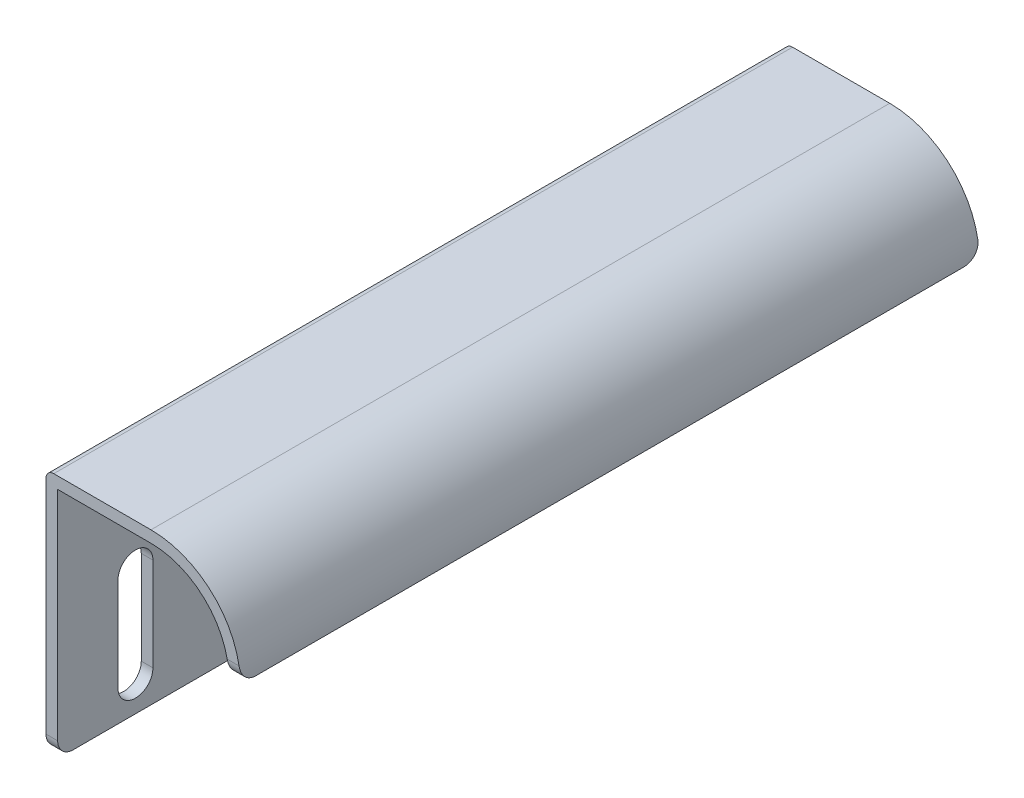
ISO-10303-21;
HEADER;
FILE_DESCRIPTION(('STEP AP214'),'2;1');
FILE_NAME('part.step','',(''),(''),'','','');
FILE_SCHEMA(('AUTOMOTIVE_DESIGN { 1 0 10303 214 1 1 1 1 }'));
ENDSEC;
DATA;
#1=APPLICATION_CONTEXT('core data for automotive mechanical design processes');
#2=APPLICATION_PROTOCOL_DEFINITION('international standard','automotive_design',2000,#1);
#3=PRODUCT_CONTEXT('',#1,'mechanical');
#4=PRODUCT('Part','Part','',(#3));
#5=PRODUCT_RELATED_PRODUCT_CATEGORY('part','',(#4));
#6=PRODUCT_DEFINITION_FORMATION('','',#4);
#7=PRODUCT_DEFINITION_CONTEXT('part definition',#1,'design');
#8=PRODUCT_DEFINITION('design','',#6,#7);
#9=PRODUCT_DEFINITION_SHAPE('','',#8);
#10=(LENGTH_UNIT() NAMED_UNIT(*) SI_UNIT(.MILLI.,.METRE.));
#11=(NAMED_UNIT(*) PLANE_ANGLE_UNIT() SI_UNIT($,.RADIAN.));
#12=(NAMED_UNIT(*) SI_UNIT($,.STERADIAN.) SOLID_ANGLE_UNIT());
#13=UNCERTAINTY_MEASURE_WITH_UNIT(LENGTH_MEASURE(1.E-05),#10,'distance_accuracy_value','');
#14=(GEOMETRIC_REPRESENTATION_CONTEXT(3) GLOBAL_UNCERTAINTY_ASSIGNED_CONTEXT((#13)) GLOBAL_UNIT_ASSIGNED_CONTEXT((#10,
#11,#12)) REPRESENTATION_CONTEXT('',''));
#15=CARTESIAN_POINT('',(0.,0.,0.));
#16=DIRECTION('',(0.,0.,1.));
#17=DIRECTION('',(1.,0.,0.));
#18=AXIS2_PLACEMENT_3D('',#15,#16,#17);
#19=CARTESIAN_POINT('',(-8.26339285714285,-19.4162946428571,95.));
#20=DIRECTION('',(0.,1.,0.));
#21=DIRECTION('',(0.,0.,1.));
#22=AXIS2_PLACEMENT_3D('',#19,#20,#21);
#23=PLANE('',#22);
#24=DIRECTION('',(0.,0.,-1.));
#25=VECTOR('',#24,1.);
#26=CARTESIAN_POINT('',(-8.26339285714285,-19.4162946428571,95.));
#27=LINE('',#26,#25);
#28=CARTESIAN_POINT('',(-8.26339285714285,-19.4162946428571,93.));
#29=VERTEX_POINT('',#28);
#30=CARTESIAN_POINT('',(-8.26339285714285,-19.4162946428571,2.));
#31=VERTEX_POINT('',#30);
#32=EDGE_CURVE('E296',#29,#31,#27,.T.);
#33=ORIENTED_EDGE('',*,*,#32,.F.);
#34=DIRECTION('',(1.,0.,0.));
#35=VECTOR('',#34,1.);
#36=CARTESIAN_POINT('',(-9.76339285714285,-19.4162946428571,93.));
#37=LINE('',#36,#35);
#38=CARTESIAN_POINT('',(-9.76339285714285,-19.4162946428571,93.));
#39=VERTEX_POINT('',#38);
#40=EDGE_CURVE('E321',#29,#39,#37,.F.);
#41=ORIENTED_EDGE('',*,*,#40,.T.);
#42=DIRECTION('',(0.,0.,-1.));
#43=VECTOR('',#42,1.);
#44=CARTESIAN_POINT('',(-9.76339285714285,-19.4162946428571,95.));
#45=LINE('',#44,#43);
#46=CARTESIAN_POINT('',(-9.76339285714285,-19.4162946428571,2.));
#47=VERTEX_POINT('',#46);
#48=EDGE_CURVE('E265',#39,#47,#45,.T.);
#49=ORIENTED_EDGE('',*,*,#48,.T.);
#50=DIRECTION('',(1.,0.,0.));
#51=VECTOR('',#50,1.);
#52=CARTESIAN_POINT('',(-8.26339285714285,-19.4162946428571,2.));
#53=LINE('',#52,#51);
#54=EDGE_CURVE('E318',#47,#31,#53,.T.);
#55=ORIENTED_EDGE('',*,*,#54,.T.);
#56=EDGE_LOOP('',(#33,#41,#49,#55));
#57=FACE_BOUND('',#56,.T.);
#58=ADVANCED_FACE('F33',(#57),#23,.F.);
#59=CARTESIAN_POINT('',(-8.26339285714285,10.5837053571429,95.));
#60=DIRECTION('',(-1.,0.,0.));
#61=DIRECTION('',(0.,-1.,0.));
#62=AXIS2_PLACEMENT_3D('',#59,#60,#61);
#63=PLANE('',#62);
#64=DIRECTION('',(0.,-1.,0.));
#65=VECTOR('',#64,1.);
#66=CARTESIAN_POINT('',(-8.26339285714285,-3.41629464285714,12.25));
#67=LINE('',#66,#65);
#68=CARTESIAN_POINT('',(-8.26339285714285,-3.41629464285714,12.25));
#69=VERTEX_POINT('',#68);
#70=CARTESIAN_POINT('',(-8.26339285714285,-15.4162946428571,12.25));
#71=VERTEX_POINT('',#70);
#72=EDGE_CURVE('E207',#69,#71,#67,.T.);
#73=ORIENTED_EDGE('',*,*,#72,.F.);
#74=CARTESIAN_POINT('',(-8.26339285714285,-3.41629464285714,10.));
#75=DIRECTION('',(1.,0.,0.));
#76=DIRECTION('',(0.,1.,0.));
#77=AXIS2_PLACEMENT_3D('',#74,#75,#76);
#78=CIRCLE('',#77,2.25);
#79=CARTESIAN_POINT('',(-8.26339285714285,-3.41629464285714,7.75));
#80=VERTEX_POINT('',#79);
#81=EDGE_CURVE('E53',#80,#69,#78,.T.);
#82=ORIENTED_EDGE('',*,*,#81,.F.);
#83=DIRECTION('',(0.,1.,0.));
#84=VECTOR('',#83,1.);
#85=CARTESIAN_POINT('',(-8.26339285714285,-3.41629464285714,7.75));
#86=LINE('',#85,#84);
#87=CARTESIAN_POINT('',(-8.26339285714285,-15.4162946428571,7.74999999999999));
#88=VERTEX_POINT('',#87);
#89=EDGE_CURVE('E198',#88,#80,#86,.T.);
#90=ORIENTED_EDGE('',*,*,#89,.F.);
#91=CARTESIAN_POINT('',(-8.26339285714285,-15.4162946428571,9.99999999999999));
#92=DIRECTION('',(1.,0.,0.));
#93=DIRECTION('',(0.,1.,0.));
#94=AXIS2_PLACEMENT_3D('',#91,#92,#93);
#95=CIRCLE('',#94,2.25);
#96=EDGE_CURVE('E201',#71,#88,#95,.T.);
#97=ORIENTED_EDGE('',*,*,#96,.F.);
#98=EDGE_LOOP('',(#73,#82,#90,#97));
#99=FACE_BOUND('',#98,.T.);
#100=DIRECTION('',(0.,-1.,0.));
#101=VECTOR('',#100,1.);
#102=CARTESIAN_POINT('',(-8.26339285714285,-3.41629464285714,87.25));
#103=LINE('',#102,#101);
#104=CARTESIAN_POINT('',(-8.26339285714285,-3.41629464285714,87.25));
#105=VERTEX_POINT('',#104);
#106=CARTESIAN_POINT('',(-8.26339285714285,-15.4162946428571,87.25));
#107=VERTEX_POINT('',#106);
#108=EDGE_CURVE('E232',#105,#107,#103,.T.);
#109=ORIENTED_EDGE('',*,*,#108,.F.);
#110=CARTESIAN_POINT('',(-8.26339285714285,-3.41629464285714,85.));
#111=DIRECTION('',(1.,0.,0.));
#112=DIRECTION('',(0.,1.,0.));
#113=AXIS2_PLACEMENT_3D('',#110,#111,#112);
#114=CIRCLE('',#113,2.25);
#115=CARTESIAN_POINT('',(-8.26339285714285,-3.41629464285714,82.75));
#116=VERTEX_POINT('',#115);
#117=EDGE_CURVE('E213',#116,#105,#114,.T.);
#118=ORIENTED_EDGE('',*,*,#117,.F.);
#119=DIRECTION('',(0.,1.,0.));
#120=VECTOR('',#119,1.);
#121=CARTESIAN_POINT('',(-8.26339285714285,-3.41629464285714,82.75));
#122=LINE('',#121,#120);
#123=CARTESIAN_POINT('',(-8.26339285714285,-15.4162946428571,82.75));
#124=VERTEX_POINT('',#123);
#125=EDGE_CURVE('E221',#124,#116,#122,.T.);
#126=ORIENTED_EDGE('',*,*,#125,.F.);
#127=CARTESIAN_POINT('',(-8.26339285714285,-15.4162946428571,85.));
#128=DIRECTION('',(1.,0.,0.));
#129=DIRECTION('',(0.,1.,0.));
#130=AXIS2_PLACEMENT_3D('',#127,#128,#129);
#131=CIRCLE('',#130,2.25);
#132=EDGE_CURVE('E235',#107,#124,#131,.T.);
#133=ORIENTED_EDGE('',*,*,#132,.F.);
#134=EDGE_LOOP('',(#109,#118,#126,#133));
#135=FACE_BOUND('',#134,.T.);
#136=DIRECTION('',(0.,1.,0.));
#137=VECTOR('',#136,1.);
#138=CARTESIAN_POINT('',(-8.26339285714285,10.5837053571429,95.));
#139=LINE('',#138,#137);
#140=CARTESIAN_POINT('',(-8.26339285714285,-17.4162946428571,95.));
#141=VERTEX_POINT('',#140);
#142=CARTESIAN_POINT('',(-8.26339285714285,10.5837053571429,95.));
#143=VERTEX_POINT('',#142);
#144=EDGE_CURVE('E249',#141,#143,#139,.T.);
#145=ORIENTED_EDGE('',*,*,#144,.F.);
#146=CARTESIAN_POINT('',(-8.26339285714285,-17.4162946428571,93.));
#147=DIRECTION('',(-1.,0.,0.));
#148=DIRECTION('',(0.,-1.,0.));
#149=AXIS2_PLACEMENT_3D('',#146,#147,#148);
#150=CIRCLE('',#149,2.);
#151=EDGE_CURVE('E316',#141,#29,#150,.F.);
#152=ORIENTED_EDGE('',*,*,#151,.T.);
#153=ORIENTED_EDGE('',*,*,#32,.T.);
#154=CARTESIAN_POINT('',(-8.26339285714285,-17.4162946428571,2.));
#155=DIRECTION('',(-1.,0.,0.));
#156=DIRECTION('',(0.,-1.,0.));
#157=AXIS2_PLACEMENT_3D('',#154,#155,#156);
#158=CIRCLE('',#157,2.);
#159=CARTESIAN_POINT('',(-8.26339285714285,-17.4162946428571,0.));
#160=VERTEX_POINT('',#159);
#161=EDGE_CURVE('E314',#31,#160,#158,.F.);
#162=ORIENTED_EDGE('',*,*,#161,.T.);
#163=DIRECTION('',(0.,1.,0.));
#164=VECTOR('',#163,1.);
#165=CARTESIAN_POINT('',(-8.26339285714285,10.5837053571429,0.));
#166=LINE('',#165,#164);
#167=CARTESIAN_POINT('',(-8.26339285714285,10.5837053571429,0.));
#168=VERTEX_POINT('',#167);
#169=EDGE_CURVE('E242',#160,#168,#166,.T.);
#170=ORIENTED_EDGE('',*,*,#169,.T.);
#171=DIRECTION('',(0.,0.,-1.));
#172=VECTOR('',#171,1.);
#173=CARTESIAN_POINT('',(-8.26339285714285,10.5837053571429,95.));
#174=LINE('',#173,#172);
#175=EDGE_CURVE('E293',#143,#168,#174,.T.);
#176=ORIENTED_EDGE('',*,*,#175,.F.);
#177=EDGE_LOOP('',(#145,#152,#153,#162,#170,#176));
#178=FACE_BOUND('',#177,.T.);
#179=ADVANCED_FACE('F427',(#99,#135,#178),#63,.F.);
#180=CARTESIAN_POINT('',(3.73660714285715,10.5837053571429,95.));
#181=DIRECTION('',(0.,1.,0.));
#182=DIRECTION('',(-1.,0.,0.));
#183=AXIS2_PLACEMENT_3D('',#180,#181,#182);
#184=PLANE('',#183);
#185=DIRECTION('',(1.,0.,0.));
#186=VECTOR('',#185,1.);
#187=CARTESIAN_POINT('',(3.73660714285715,10.5837053571429,0.));
#188=LINE('',#187,#186);
#189=CARTESIAN_POINT('',(3.73660714285715,10.5837053571429,0.));
#190=VERTEX_POINT('',#189);
#191=EDGE_CURVE('E267',#168,#190,#188,.T.);
#192=ORIENTED_EDGE('',*,*,#191,.T.);
#193=DIRECTION('',(0.,0.,-1.));
#194=VECTOR('',#193,1.);
#195=CARTESIAN_POINT('',(3.73660714285715,10.5837053571429,95.));
#196=LINE('',#195,#194);
#197=CARTESIAN_POINT('',(3.73660714285715,10.5837053571429,95.));
#198=VERTEX_POINT('',#197);
#199=EDGE_CURVE('E290',#198,#190,#196,.T.);
#200=ORIENTED_EDGE('',*,*,#199,.F.);
#201=DIRECTION('',(1.,0.,0.));
#202=VECTOR('',#201,1.);
#203=CARTESIAN_POINT('',(3.73660714285715,10.5837053571429,95.));
#204=LINE('',#203,#202);
#205=EDGE_CURVE('E251',#143,#198,#204,.T.);
#206=ORIENTED_EDGE('',*,*,#205,.F.);
#207=ORIENTED_EDGE('',*,*,#175,.T.);
#208=EDGE_LOOP('',(#192,#200,#206,#207));
#209=FACE_BOUND('',#208,.T.);
#210=ADVANCED_FACE('F361',(#209),#184,.F.);
#211=CARTESIAN_POINT('',(3.73660714285715,0.583705357142856,95.));
#212=DIRECTION('',(0.,0.,-1.));
#213=DIRECTION('',(-1.,0.,0.));
#214=AXIS2_PLACEMENT_3D('',#211,#212,#213);
#215=CYLINDRICAL_SURFACE('',#214,10.);
#216=CARTESIAN_POINT('',(3.73660714285715,0.583705357142856,0.));
#217=DIRECTION('',(0.,0.,-1.));
#218=DIRECTION('',(1.,0.,0.));
#219=AXIS2_PLACEMENT_3D('',#216,#217,#218);
#220=CIRCLE('',#219,10.);
#221=CARTESIAN_POINT('',(13.5345661139899,2.58370535714286,0.));
#222=VERTEX_POINT('',#221);
#223=EDGE_CURVE('E269',#190,#222,#220,.T.);
#224=ORIENTED_EDGE('',*,*,#223,.T.);
#225=CARTESIAN_POINT('',(13.5345661139899,2.58370535714286,0.));
#226=CARTESIAN_POINT('',(13.5458010250787,2.52867799222261,3.46608117530077E-07));
#227=CARTESIAN_POINT('',(13.5565622376508,2.47357803549689,0.00227269256263796));
#228=CARTESIAN_POINT('',(13.5770956591324,2.36356795740072,0.0113849720951567));
#229=CARTESIAN_POINT('',(13.5868677893794,2.30865785146417,0.0182252686379702));
#230=CARTESIAN_POINT('',(13.6146100157886,2.14487893382644,0.0456077152932892));
#231=CARTESIAN_POINT('',(13.6310371936347,2.0368077397862,0.0730113116226209));
#232=CARTESIAN_POINT('',(13.6596930386861,1.82616632788071,0.145660206872246));
#233=CARTESIAN_POINT('',(13.6719170439119,1.72360232403151,0.190925198193005));
#234=CARTESIAN_POINT('',(13.6924872875734,1.52720911053611,0.298142274878758));
#235=CARTESIAN_POINT('',(13.7008350052103,1.43337657988534,0.360087980559907));
#236=CARTESIAN_POINT('',(13.714218501676,1.2581892780356,0.498225611437986));
#237=CARTESIAN_POINT('',(13.7192876292854,1.17671553294687,0.574263628365167));
#238=CARTESIAN_POINT('',(13.7270374339581,1.02744292236356,0.738891372453701));
#239=CARTESIAN_POINT('',(13.729717458694,0.959647795623946,0.827484520054885));
#240=CARTESIAN_POINT('',(13.7335193355851,0.839427629037852,1.01512871159789));
#241=CARTESIAN_POINT('',(13.7346341589812,0.787072750868916,1.11422479434481));
#242=CARTESIAN_POINT('',(13.736031155759,0.69963771641441,1.31974656485594));
#243=CARTESIAN_POINT('',(13.7363137357234,0.664549131865625,1.42616864757444));
#244=CARTESIAN_POINT('',(13.7365568218582,0.620356134878248,1.6108926079058));
#245=CARTESIAN_POINT('',(13.7365882248183,0.606624015938174,1.68812060465722));
#246=CARTESIAN_POINT('',(13.7366071440915,0.58829720729927,1.8435555515656));
#247=CARTESIAN_POINT('',(13.7365947148904,0.583691184483444,1.92176116601144));
#248=CARTESIAN_POINT('',(13.7366071428571,0.583705357142856,2.));
#249=B_SPLINE_CURVE_WITH_KNOTS('',3,(#225,#226,#227,#228,#229,#230,#231,#232,#233,#234,#235,
#236,#237,#238,#239,#240,#241,#242,#243,#244,#245,#246,#247,#248),.UNSPECIFIED.,.F.,.F.,(4,2,2,
2,2,2,2,2,2,2,2,4),(0.,0.16839082338939,0.336795028538608,0.673138573401838,1.00985398178611,
1.3464407929008,1.67954774299098,2.01274561769816,2.34743503044951,2.68196090748717,
2.9167697004481,3.15128671611927),.UNSPECIFIED.);
#250=CARTESIAN_POINT('',(13.7366071428571,0.583705357142856,2.));
#251=VERTEX_POINT('',#250);
#252=EDGE_CURVE('E11',#222,#251,#249,.T.);
#253=ORIENTED_EDGE('',*,*,#252,.T.);
#254=DIRECTION('',(0.,0.,-1.));
#255=VECTOR('',#254,1.);
#256=CARTESIAN_POINT('',(13.7366071428571,0.583705357142856,95.));
#257=LINE('',#256,#255);
#258=CARTESIAN_POINT('',(13.7366071428571,0.583705357142856,93.));
#259=VERTEX_POINT('',#258);
#260=EDGE_CURVE('E287',#259,#251,#257,.T.);
#261=ORIENTED_EDGE('',*,*,#260,.F.);
#262=CARTESIAN_POINT('',(13.7366071428571,0.583705357142856,93.));
#263=CARTESIAN_POINT('',(13.736604411201,0.58370573418218,93.0562472332468));
#264=CARTESIAN_POINT('',(13.7366074500463,0.586079658917677,93.1124675260761));
#265=CARTESIAN_POINT('',(13.7366017811834,0.595550241473175,93.2245062166446));
#266=CARTESIAN_POINT('',(13.7365930740188,0.602646680711872,93.2803246328639));
#267=CARTESIAN_POINT('',(13.7365144902917,0.630953719460037,93.4464877502531));
#268=CARTESIAN_POINT('',(13.7363922898197,0.659182217866402,93.55572019439));
#269=CARTESIAN_POINT('',(13.7355524751899,0.733570902402936,93.767896090143));
#270=CARTESIAN_POINT('',(13.7348345619706,0.779740088981506,93.8708363550653));
#271=CARTESIAN_POINT('',(13.7321032522401,0.888689058081749,94.067494884805));
#272=CARTESIAN_POINT('',(13.7300900763002,0.951466011384793,94.1612147166435));
#273=CARTESIAN_POINT('',(13.7239414016681,1.09169831785158,94.3366012397715));
#274=CARTESIAN_POINT('',(13.7198094707155,1.16912885821161,94.4182878968303));
#275=CARTESIAN_POINT('',(13.7085863794737,1.33646298285433,94.5674649874442));
#276=CARTESIAN_POINT('',(13.7014951338671,1.42636692669654,94.6349550116245));
#277=CARTESIAN_POINT('',(13.6837070566547,1.61527382200096,94.7534225596004));
#278=CARTESIAN_POINT('',(13.6730350795975,1.71421071889456,94.8045092841587));
#279=CARTESIAN_POINT('',(13.6476265934684,1.9187287960191,94.889458521177));
#280=CARTESIAN_POINT('',(13.6328913516364,2.02430789678675,94.9233263944552));
#281=CARTESIAN_POINT('',(13.6044233892396,2.2060148362101,94.9655027209226));
#282=CARTESIAN_POINT('',(13.59176338612,2.28126989761265,94.978460947594));
#283=CARTESIAN_POINT('',(13.5645580104113,2.43230695376372,94.9957100108423));
#284=CARTESIAN_POINT('',(13.5500156458145,2.50808792908203,95.0000144983641));
#285=CARTESIAN_POINT('',(13.5345661139899,2.58370535714286,95.));
#286=B_SPLINE_CURVE_WITH_KNOTS('',3,(#262,#263,#264,#265,#266,#267,#268,#269,#270,#271,#272,
#273,#274,#275,#276,#277,#278,#279,#280,#281,#282,#283,#284,#285),.UNSPECIFIED.,.F.,.F.,(4,2,2,
2,2,2,2,2,2,2,2,4),(0.,0.168638105248133,0.337268405634316,0.673996246708665,1.01089323527803,
1.34773286862535,1.68400715637148,2.02029113960701,2.35428760468357,2.68818002144572,
2.91991219621429,3.15127853454384),.UNSPECIFIED.);
#287=CARTESIAN_POINT('',(13.5345661139899,2.58370535714286,95.));
#288=VERTEX_POINT('',#287);
#289=EDGE_CURVE('E46',#259,#288,#286,.T.);
#290=ORIENTED_EDGE('',*,*,#289,.T.);
#291=CARTESIAN_POINT('',(3.73660714285715,0.583705357142856,95.));
#292=DIRECTION('',(0.,0.,-1.));
#293=DIRECTION('',(1.,0.,0.));
#294=AXIS2_PLACEMENT_3D('',#291,#292,#293);
#295=CIRCLE('',#294,10.);
#296=EDGE_CURVE('E254',#198,#288,#295,.T.);
#297=ORIENTED_EDGE('',*,*,#296,.F.);
#298=ORIENTED_EDGE('',*,*,#199,.T.);
#299=EDGE_LOOP('',(#224,#253,#261,#290,#297,#298));
#300=FACE_BOUND('',#299,.T.);
#301=ADVANCED_FACE('F356',(#300),#215,.F.);
#302=CARTESIAN_POINT('',(13.7366071428571,0.583705357142856,95.));
#303=DIRECTION('',(0.,1.,0.));
#304=DIRECTION('',(0.,0.,1.));
#305=AXIS2_PLACEMENT_3D('',#302,#303,#304);
#306=PLANE('',#305);
#307=ORIENTED_EDGE('',*,*,#260,.T.);
#308=DIRECTION('',(1.,0.,0.));
#309=VECTOR('',#308,1.);
#310=CARTESIAN_POINT('',(13.7366071428571,0.583705357142856,2.));
#311=LINE('',#310,#309);
#312=CARTESIAN_POINT('',(15.2366071428571,0.583705357142856,2.));
#313=VERTEX_POINT('',#312);
#314=EDGE_CURVE('E329',#251,#313,#311,.T.);
#315=ORIENTED_EDGE('',*,*,#314,.T.);
#316=DIRECTION('',(0.,0.,-1.));
#317=VECTOR('',#316,1.);
#318=CARTESIAN_POINT('',(15.2366071428571,0.583705357142856,95.));
#319=LINE('',#318,#317);
#320=CARTESIAN_POINT('',(15.2366071428571,0.583705357142856,93.));
#321=VERTEX_POINT('',#320);
#322=EDGE_CURVE('E284',#321,#313,#319,.T.);
#323=ORIENTED_EDGE('',*,*,#322,.F.);
#324=DIRECTION('',(1.,0.,0.));
#325=VECTOR('',#324,1.);
#326=CARTESIAN_POINT('',(13.7366071428571,0.583705357142856,93.));
#327=LINE('',#326,#325);
#328=EDGE_CURVE('E327',#321,#259,#327,.F.);
#329=ORIENTED_EDGE('',*,*,#328,.T.);
#330=EDGE_LOOP('',(#307,#315,#323,#329));
#331=FACE_BOUND('',#330,.T.);
#332=ADVANCED_FACE('F351',(#331),#306,.F.);
#333=CARTESIAN_POINT('',(3.73660714285715,0.583705357142856,95.));
#334=DIRECTION('',(0.,0.,-1.));
#335=DIRECTION('',(-1.,0.,0.));
#336=AXIS2_PLACEMENT_3D('',#333,#334,#335);
#337=CYLINDRICAL_SURFACE('',#336,11.5);
#338=ORIENTED_EDGE('',*,*,#322,.T.);
#339=CARTESIAN_POINT('',(15.2366071428571,0.583705357142856,2.));
#340=CARTESIAN_POINT('',(15.2366047665326,0.583705733494071,1.94374733309183));
#341=CARTESIAN_POINT('',(15.2366074100509,0.586080117736604,1.88752161076205));
#342=CARTESIAN_POINT('',(15.2366024787633,0.595552525971112,1.77547219969166));
#343=CARTESIAN_POINT('',(15.2365949044345,0.602650329400052,1.71964849230175));
#344=CARTESIAN_POINT('',(15.2365265451349,0.630962472029634,1.55347174240439));
#345=CARTESIAN_POINT('',(15.2364202454776,0.659195723698854,1.44423123685087));
#346=CARTESIAN_POINT('',(15.2356897347742,0.733596479065714,1.23204102943311));
#347=CARTESIAN_POINT('',(15.2350652663609,0.779772888817918,1.12909448097632));
#348=CARTESIAN_POINT('',(15.2326896009195,0.888740057234753,0.932423017000871));
#349=CARTESIAN_POINT('',(15.2309385971855,0.951527964564253,0.838696522659691));
#350=CARTESIAN_POINT('',(15.2255898496891,1.0918223683925,0.663254889531236));
#351=CARTESIAN_POINT('',(15.2219944587228,1.16931003394416,0.581524618161985));
#352=CARTESIAN_POINT('',(15.21222750984,1.33680385364802,0.432257171495056));
#353=CARTESIAN_POINT('',(15.2060557738606,1.42681087278295,0.364720977699811));
#354=CARTESIAN_POINT('',(15.1905584314503,1.61616281151284,0.246065605896685));
#355=CARTESIAN_POINT('',(15.181249106665,1.7154576507377,0.194864279865427));
#356=CARTESIAN_POINT('',(15.1590738699951,1.92082733702226,0.109779983555673));
#357=CARTESIAN_POINT('',(15.1462093032124,2.02689960824057,0.0758904772522356));
#358=CARTESIAN_POINT('',(15.1214787825883,2.20859387917988,0.0340277637460682));
#359=CARTESIAN_POINT('',(15.1105752076344,2.2832803623807,0.0212533161993631));
#360=CARTESIAN_POINT('',(15.087157585431,2.43325114875475,0.00423942778068288));
#361=CARTESIAN_POINT('',(15.0746460459684,2.50853435325199,-1.31360102521087E-05));
#362=CARTESIAN_POINT('',(15.0613587957633,2.58370535714286,0.));
#363=B_SPLINE_CURVE_WITH_KNOTS('',3,(#339,#340,#341,#342,#343,#344,#345,#346,#347,#348,#349,
#350,#351,#352,#353,#354,#355,#356,#357,#358,#359,#360,#361,#362),.UNSPECIFIED.,.F.,.F.,(4,2,2,
2,2,2,2,2,2,2,2,4),(0.,0.168654383720686,0.337300892571235,0.674055343452162,1.01097715575047,
1.34784117347518,1.68427653462033,2.02073515219471,2.35547402584557,2.69008642627285,
2.9192744825752,3.14810933826063),.UNSPECIFIED.);
#364=CARTESIAN_POINT('',(15.0613587957633,2.58370535714286,0.));
#365=VERTEX_POINT('',#364);
#366=EDGE_CURVE('E338',#313,#365,#363,.T.);
#367=ORIENTED_EDGE('',*,*,#366,.T.);
#368=CARTESIAN_POINT('',(3.73660714285715,0.583705357142856,0.));
#369=DIRECTION('',(0.,0.,1.));
#370=DIRECTION('',(1.,0.,0.));
#371=AXIS2_PLACEMENT_3D('',#368,#369,#370);
#372=CIRCLE('',#371,11.5);
#373=CARTESIAN_POINT('',(3.73660714285715,12.0837053571429,0.));
#374=VERTEX_POINT('',#373);
#375=EDGE_CURVE('E272',#365,#374,#372,.T.);
#376=ORIENTED_EDGE('',*,*,#375,.T.);
#377=DIRECTION('',(0.,0.,-1.));
#378=VECTOR('',#377,1.);
#379=CARTESIAN_POINT('',(3.73660714285715,12.0837053571429,95.));
#380=LINE('',#379,#378);
#381=CARTESIAN_POINT('',(3.73660714285715,12.0837053571429,95.));
#382=VERTEX_POINT('',#381);
#383=EDGE_CURVE('E281',#382,#374,#380,.T.);
#384=ORIENTED_EDGE('',*,*,#383,.F.);
#385=CARTESIAN_POINT('',(3.73660714285715,0.583705357142856,95.));
#386=DIRECTION('',(0.,0.,1.));
#387=DIRECTION('',(1.,0.,0.));
#388=AXIS2_PLACEMENT_3D('',#385,#386,#387);
#389=CIRCLE('',#388,11.5);
#390=CARTESIAN_POINT('',(15.0613587957633,2.58370535714286,95.));
#391=VERTEX_POINT('',#390);
#392=EDGE_CURVE('E257',#391,#382,#389,.T.);
#393=ORIENTED_EDGE('',*,*,#392,.F.);
#394=CARTESIAN_POINT('',(15.0613587957633,2.58370535714286,95.));
#395=CARTESIAN_POINT('',(15.0711328305294,2.52837359024194,94.9999996513832));
#396=CARTESIAN_POINT('',(15.0804922929396,2.47299337801583,94.9977021561113));
#397=CARTESIAN_POINT('',(15.098345910027,2.36247438704464,94.9885007838926));
#398=CARTESIAN_POINT('',(15.1068400222138,2.30733562028211,94.9815966808774));
#399=CARTESIAN_POINT('',(15.1309454179746,2.14295598747906,94.9539833366486));
#400=CARTESIAN_POINT('',(15.1452082670248,2.03458961880191,94.9263731092368));
#401=CARTESIAN_POINT('',(15.1700716855249,1.82355262160294,94.8532850903554));
#402=CARTESIAN_POINT('',(15.1806687434669,1.720887532982,94.8077902556051));
#403=CARTESIAN_POINT('',(15.1984918469496,1.52441246721248,94.7001279887697));
#404=CARTESIAN_POINT('',(15.2057190080554,1.43059956786417,94.6379660848719));
#405=CARTESIAN_POINT('',(15.2173136245921,1.25530975283912,94.4992542670316));
#406=CARTESIAN_POINT('',(15.221703081784,1.17374178689706,94.4228211207412));
#407=CARTESIAN_POINT('',(15.228403631639,1.02440379870996,94.257377490443));
#408=CARTESIAN_POINT('',(15.2307141954541,0.95663729079651,94.1683638127439));
#409=CARTESIAN_POINT('',(15.2339827762529,0.836652039242905,93.979962296246));
#410=CARTESIAN_POINT('',(15.2349360481747,0.784488342093656,93.8805393605427));
#411=CARTESIAN_POINT('',(15.236126574404,0.6975203125064,93.6743920437252));
#412=CARTESIAN_POINT('',(15.2363641953391,0.662707099059269,93.5676714298757));
#413=CARTESIAN_POINT('',(15.2365657459129,0.619332869791086,93.3836858145743));
#414=CARTESIAN_POINT('',(15.2365915759581,0.605983250546152,93.3075140258903));
#415=CARTESIAN_POINT('',(15.236607167463,0.588168760836362,93.1542383557513));
#416=CARTESIAN_POINT('',(15.2365969753557,0.583692464169517,93.0771358018075));
#417=CARTESIAN_POINT('',(15.2366071428571,0.583705357142855,93.));
#418=B_SPLINE_CURVE_WITH_KNOTS('',3,(#394,#395,#396,#397,#398,#399,#400,#401,#402,#403,#404,
#405,#406,#407,#408,#409,#410,#411,#412,#413,#414,#415,#416,#417),.UNSPECIFIED.,.F.,.F.,(4,2,2,
2,2,2,2,2,2,2,2,4),(0.,0.168466723413753,0.336941714905658,0.67340394964313,1.01018759907925,
1.34685968091525,1.68088907971363,2.01500342797166,2.35028298838728,2.68539075608142,
2.91690244341342,3.14811581834515),.UNSPECIFIED.);
#419=EDGE_CURVE('E332',#391,#321,#418,.T.);
#420=ORIENTED_EDGE('',*,*,#419,.T.);
#421=EDGE_LOOP('',(#338,#367,#376,#384,#393,#420));
#422=FACE_BOUND('',#421,.T.);
#423=ADVANCED_FACE('F345',(#422),#337,.T.);
#424=CARTESIAN_POINT('',(-9.76339285714285,12.0837053571429,95.));
#425=DIRECTION('',(0.,-1.,0.));
#426=DIRECTION('',(0.,0.,-1.));
#427=AXIS2_PLACEMENT_3D('',#424,#425,#426);
#428=PLANE('',#427);
#429=DIRECTION('',(-1.,0.,0.));
#430=VECTOR('',#429,1.);
#431=CARTESIAN_POINT('',(-9.76339285714285,12.0837053571429,0.));
#432=LINE('',#431,#430);
#433=CARTESIAN_POINT('',(-8.76339285714285,12.0837053571429,0.));
#434=VERTEX_POINT('',#433);
#435=EDGE_CURVE('E274',#374,#434,#432,.T.);
#436=ORIENTED_EDGE('',*,*,#435,.T.);
#437=DIRECTION('',(0.,0.,-1.));
#438=VECTOR('',#437,1.);
#439=CARTESIAN_POINT('',(-8.76339285714285,12.0837053571429,95.));
#440=LINE('',#439,#438);
#441=CARTESIAN_POINT('',(-8.76339285714285,12.0837053571429,95.));
#442=VERTEX_POINT('',#441);
#443=EDGE_CURVE('E304',#434,#442,#440,.F.);
#444=ORIENTED_EDGE('',*,*,#443,.T.);
#445=DIRECTION('',(-1.,0.,0.));
#446=VECTOR('',#445,1.);
#447=CARTESIAN_POINT('',(-9.76339285714285,12.0837053571429,95.));
#448=LINE('',#447,#446);
#449=EDGE_CURVE('E259',#382,#442,#448,.T.);
#450=ORIENTED_EDGE('',*,*,#449,.F.);
#451=ORIENTED_EDGE('',*,*,#383,.T.);
#452=EDGE_LOOP('',(#436,#444,#450,#451));
#453=FACE_BOUND('',#452,.T.);
#454=ADVANCED_FACE('F350',(#453),#428,.F.);
#455=CARTESIAN_POINT('',(-9.76339285714285,-19.4162946428571,95.));
#456=DIRECTION('',(1.,0.,0.));
#457=DIRECTION('',(0.,0.,-1.));
#458=AXIS2_PLACEMENT_3D('',#455,#456,#457);
#459=PLANE('',#458);
#460=DIRECTION('',(0.,1.,0.));
#461=VECTOR('',#460,1.);
#462=CARTESIAN_POINT('',(-9.76339285714285,-3.41629464285714,7.75));
#463=LINE('',#462,#461);
#464=CARTESIAN_POINT('',(-9.76339285714285,-15.4162946428571,7.74999999999999));
#465=VERTEX_POINT('',#464);
#466=CARTESIAN_POINT('',(-9.76339285714285,-3.41629464285714,7.75));
#467=VERTEX_POINT('',#466);
#468=EDGE_CURVE('E188',#465,#467,#463,.T.);
#469=ORIENTED_EDGE('',*,*,#468,.T.);
#470=CARTESIAN_POINT('',(-9.76339285714285,-3.41629464285714,10.));
#471=DIRECTION('',(1.,0.,0.));
#472=DIRECTION('',(0.,1.,0.));
#473=AXIS2_PLACEMENT_3D('',#470,#471,#472);
#474=CIRCLE('',#473,2.25);
#475=CARTESIAN_POINT('',(-9.76339285714285,-3.41629464285714,12.25));
#476=VERTEX_POINT('',#475);
#477=EDGE_CURVE('E182',#467,#476,#474,.T.);
#478=ORIENTED_EDGE('',*,*,#477,.T.);
#479=DIRECTION('',(0.,-1.,0.));
#480=VECTOR('',#479,1.);
#481=CARTESIAN_POINT('',(-9.76339285714285,-3.41629464285714,12.25));
#482=LINE('',#481,#480);
#483=CARTESIAN_POINT('',(-9.76339285714285,-15.4162946428571,12.25));
#484=VERTEX_POINT('',#483);
#485=EDGE_CURVE('E191',#476,#484,#482,.T.);
#486=ORIENTED_EDGE('',*,*,#485,.T.);
#487=CARTESIAN_POINT('',(-9.76339285714285,-15.4162946428571,9.99999999999999));
#488=DIRECTION('',(1.,0.,0.));
#489=DIRECTION('',(0.,1.,0.));
#490=AXIS2_PLACEMENT_3D('',#487,#488,#489);
#491=CIRCLE('',#490,2.25);
#492=EDGE_CURVE('E61',#484,#465,#491,.T.);
#493=ORIENTED_EDGE('',*,*,#492,.T.);
#494=EDGE_LOOP('',(#469,#478,#486,#493));
#495=FACE_BOUND('',#494,.T.);
#496=DIRECTION('',(0.,1.,0.));
#497=VECTOR('',#496,1.);
#498=CARTESIAN_POINT('',(-9.76339285714285,-3.41629464285714,82.75));
#499=LINE('',#498,#497);
#500=CARTESIAN_POINT('',(-9.76339285714285,-15.4162946428571,82.75));
#501=VERTEX_POINT('',#500);
#502=CARTESIAN_POINT('',(-9.76339285714285,-3.41629464285714,82.75));
#503=VERTEX_POINT('',#502);
#504=EDGE_CURVE('E227',#501,#503,#499,.T.);
#505=ORIENTED_EDGE('',*,*,#504,.T.);
#506=CARTESIAN_POINT('',(-9.76339285714285,-3.41629464285714,85.));
#507=DIRECTION('',(1.,0.,0.));
#508=DIRECTION('',(0.,1.,0.));
#509=AXIS2_PLACEMENT_3D('',#506,#507,#508);
#510=CIRCLE('',#509,2.25);
#511=CARTESIAN_POINT('',(-9.76339285714285,-3.41629464285714,87.25));
#512=VERTEX_POINT('',#511);
#513=EDGE_CURVE('E217',#503,#512,#510,.T.);
#514=ORIENTED_EDGE('',*,*,#513,.T.);
#515=DIRECTION('',(0.,-1.,0.));
#516=VECTOR('',#515,1.);
#517=CARTESIAN_POINT('',(-9.76339285714285,-3.41629464285714,87.25));
#518=LINE('',#517,#516);
#519=CARTESIAN_POINT('',(-9.76339285714285,-15.4162946428571,87.25));
#520=VERTEX_POINT('',#519);
#521=EDGE_CURVE('E220',#512,#520,#518,.T.);
#522=ORIENTED_EDGE('',*,*,#521,.T.);
#523=CARTESIAN_POINT('',(-9.76339285714285,-15.4162946428571,85.));
#524=DIRECTION('',(1.,0.,0.));
#525=DIRECTION('',(0.,1.,0.));
#526=AXIS2_PLACEMENT_3D('',#523,#524,#525);
#527=CIRCLE('',#526,2.25);
#528=EDGE_CURVE('E224',#520,#501,#527,.T.);
#529=ORIENTED_EDGE('',*,*,#528,.T.);
#530=EDGE_LOOP('',(#505,#514,#522,#529));
#531=FACE_BOUND('',#530,.T.);
#532=ORIENTED_EDGE('',*,*,#48,.F.);
#533=CARTESIAN_POINT('',(-9.76339285714285,-17.4162946428571,93.));
#534=DIRECTION('',(1.,0.,0.));
#535=DIRECTION('',(0.,0.,-1.));
#536=AXIS2_PLACEMENT_3D('',#533,#534,#535);
#537=CIRCLE('',#536,2.);
#538=CARTESIAN_POINT('',(-9.76339285714285,-17.4162946428571,95.));
#539=VERTEX_POINT('',#538);
#540=EDGE_CURVE('E325',#39,#539,#537,.F.);
#541=ORIENTED_EDGE('',*,*,#540,.T.);
#542=DIRECTION('',(0.,-1.,0.));
#543=VECTOR('',#542,1.);
#544=CARTESIAN_POINT('',(-9.76339285714285,-19.4162946428571,95.));
#545=LINE('',#544,#543);
#546=CARTESIAN_POINT('',(-9.76339285714285,11.0837053571429,95.));
#547=VERTEX_POINT('',#546);
#548=EDGE_CURVE('E262',#547,#539,#545,.T.);
#549=ORIENTED_EDGE('',*,*,#548,.F.);
#550=DIRECTION('',(0.,0.,-1.));
#551=VECTOR('',#550,1.);
#552=CARTESIAN_POINT('',(-9.76339285714285,11.0837053571429,95.));
#553=LINE('',#552,#551);
#554=CARTESIAN_POINT('',(-9.76339285714285,11.0837053571429,0.));
#555=VERTEX_POINT('',#554);
#556=EDGE_CURVE('E299',#547,#555,#553,.T.);
#557=ORIENTED_EDGE('',*,*,#556,.T.);
#558=DIRECTION('',(0.,-1.,0.));
#559=VECTOR('',#558,1.);
#560=CARTESIAN_POINT('',(-9.76339285714285,-19.4162946428571,0.));
#561=LINE('',#560,#559);
#562=CARTESIAN_POINT('',(-9.76339285714285,-17.4162946428571,0.));
#563=VERTEX_POINT('',#562);
#564=EDGE_CURVE('E252',#555,#563,#561,.T.);
#565=ORIENTED_EDGE('',*,*,#564,.T.);
#566=CARTESIAN_POINT('',(-9.76339285714285,-17.4162946428571,2.));
#567=DIRECTION('',(1.,0.,0.));
#568=DIRECTION('',(0.,0.,-1.));
#569=AXIS2_PLACEMENT_3D('',#566,#567,#568);
#570=CIRCLE('',#569,2.);
#571=EDGE_CURVE('E323',#563,#47,#570,.F.);
#572=ORIENTED_EDGE('',*,*,#571,.T.);
#573=EDGE_LOOP('',(#532,#541,#549,#557,#565,#572));
#574=FACE_BOUND('',#573,.T.);
#575=ADVANCED_FACE('F195',(#495,#531,#574),#459,.F.);
#576=CARTESIAN_POINT('',(3.73660714285715,0.583705357142856,95.));
#577=DIRECTION('',(0.,0.,1.));
#578=DIRECTION('',(1.,0.,0.));
#579=AXIS2_PLACEMENT_3D('',#576,#577,#578);
#580=PLANE('',#579);
#581=ORIENTED_EDGE('',*,*,#548,.T.);
#582=DIRECTION('',(1.,0.,0.));
#583=VECTOR('',#582,1.);
#584=CARTESIAN_POINT('',(-8.26339285714285,-17.4162946428571,95.));
#585=LINE('',#584,#583);
#586=EDGE_CURVE('E311',#539,#141,#585,.T.);
#587=ORIENTED_EDGE('',*,*,#586,.T.);
#588=ORIENTED_EDGE('',*,*,#144,.T.);
#589=ORIENTED_EDGE('',*,*,#205,.T.);
#590=ORIENTED_EDGE('',*,*,#296,.T.);
#591=DIRECTION('',(1.,0.,0.));
#592=VECTOR('',#591,1.);
#593=CARTESIAN_POINT('',(15.2366071428571,2.58370535714286,95.));
#594=LINE('',#593,#592);
#595=EDGE_CURVE('E308',#288,#391,#594,.T.);
#596=ORIENTED_EDGE('',*,*,#595,.T.);
#597=ORIENTED_EDGE('',*,*,#392,.T.);
#598=ORIENTED_EDGE('',*,*,#449,.T.);
#599=CARTESIAN_POINT('',(-8.76339285714285,11.0837053571429,95.));
#600=DIRECTION('',(0.,0.,1.));
#601=DIRECTION('',(1.,0.,0.));
#602=AXIS2_PLACEMENT_3D('',#599,#600,#601);
#603=CIRCLE('',#602,1.);
#604=EDGE_CURVE('E306',#442,#547,#603,.T.);
#605=ORIENTED_EDGE('',*,*,#604,.T.);
#606=EDGE_LOOP('',(#581,#587,#588,#589,#590,#596,#597,#598,#605));
#607=FACE_BOUND('',#606,.T.);
#608=ADVANCED_FACE('F393',(#607),#580,.T.);
#609=CARTESIAN_POINT('',(3.73660714285715,0.583705357142856,0.));
#610=DIRECTION('',(0.,0.,1.));
#611=DIRECTION('',(1.,0.,0.));
#612=AXIS2_PLACEMENT_3D('',#609,#610,#611);
#613=PLANE('',#612);
#614=ORIENTED_EDGE('',*,*,#375,.F.);
#615=DIRECTION('',(1.,0.,0.));
#616=VECTOR('',#615,1.);
#617=CARTESIAN_POINT('',(3.73660714285715,2.58370535714286,0.));
#618=LINE('',#617,#616);
#619=EDGE_CURVE('E369',#365,#222,#618,.F.);
#620=ORIENTED_EDGE('',*,*,#619,.T.);
#621=ORIENTED_EDGE('',*,*,#223,.F.);
#622=ORIENTED_EDGE('',*,*,#191,.F.);
#623=ORIENTED_EDGE('',*,*,#169,.F.);
#624=DIRECTION('',(1.,0.,0.));
#625=VECTOR('',#624,1.);
#626=CARTESIAN_POINT('',(3.73660714285715,-17.4162946428571,0.));
#627=LINE('',#626,#625);
#628=EDGE_CURVE('E370',#160,#563,#627,.F.);
#629=ORIENTED_EDGE('',*,*,#628,.T.);
#630=ORIENTED_EDGE('',*,*,#564,.F.);
#631=CARTESIAN_POINT('',(-8.76339285714285,11.0837053571429,0.));
#632=DIRECTION('',(0.,0.,1.));
#633=DIRECTION('',(1.,0.,0.));
#634=AXIS2_PLACEMENT_3D('',#631,#632,#633);
#635=CIRCLE('',#634,1.);
#636=EDGE_CURVE('E302',#555,#434,#635,.F.);
#637=ORIENTED_EDGE('',*,*,#636,.T.);
#638=ORIENTED_EDGE('',*,*,#435,.F.);
#639=EDGE_LOOP('',(#614,#620,#621,#622,#623,#629,#630,#637,#638));
#640=FACE_BOUND('',#639,.T.);
#641=ADVANCED_FACE('F382',(#640),#613,.F.);
#642=CARTESIAN_POINT('',(-8.76339285714285,11.0837053571429,95.));
#643=DIRECTION('',(0.,0.,-1.));
#644=DIRECTION('',(-1.,0.,0.));
#645=AXIS2_PLACEMENT_3D('',#642,#643,#644);
#646=CYLINDRICAL_SURFACE('',#645,1.);
#647=ORIENTED_EDGE('',*,*,#604,.F.);
#648=ORIENTED_EDGE('',*,*,#443,.F.);
#649=ORIENTED_EDGE('',*,*,#636,.F.);
#650=ORIENTED_EDGE('',*,*,#556,.F.);
#651=EDGE_LOOP('',(#647,#648,#649,#650));
#652=FACE_BOUND('',#651,.T.);
#653=ADVANCED_FACE('F420',(#652),#646,.T.);
#654=CARTESIAN_POINT('',(3.73660714285715,-17.4162946428571,93.));
#655=DIRECTION('',(-1.,0.,0.));
#656=DIRECTION('',(0.,0.,1.));
#657=AXIS2_PLACEMENT_3D('',#654,#655,#656);
#658=CYLINDRICAL_SURFACE('',#657,2.);
#659=ORIENTED_EDGE('',*,*,#540,.F.);
#660=ORIENTED_EDGE('',*,*,#40,.F.);
#661=ORIENTED_EDGE('',*,*,#151,.F.);
#662=ORIENTED_EDGE('',*,*,#586,.F.);
#663=EDGE_LOOP('',(#659,#660,#661,#662));
#664=FACE_BOUND('',#663,.T.);
#665=ADVANCED_FACE('F412',(#664),#658,.T.);
#666=CARTESIAN_POINT('',(13.7366071428571,2.58370535714286,2.));
#667=DIRECTION('',(1.,0.,0.));
#668=DIRECTION('',(0.,0.,-1.));
#669=AXIS2_PLACEMENT_3D('',#666,#667,#668);
#670=CYLINDRICAL_SURFACE('',#669,2.);
#671=ORIENTED_EDGE('',*,*,#252,.F.);
#672=ORIENTED_EDGE('',*,*,#619,.F.);
#673=ORIENTED_EDGE('',*,*,#366,.F.);
#674=ORIENTED_EDGE('',*,*,#314,.F.);
#675=EDGE_LOOP('',(#671,#672,#673,#674));
#676=FACE_BOUND('',#675,.T.);
#677=ADVANCED_FACE('F385',(#676),#670,.T.);
#678=CARTESIAN_POINT('',(3.73660714285715,2.58370535714286,93.));
#679=DIRECTION('',(-1.,0.,0.));
#680=DIRECTION('',(0.,0.,1.));
#681=AXIS2_PLACEMENT_3D('',#678,#679,#680);
#682=CYLINDRICAL_SURFACE('',#681,2.);
#683=ORIENTED_EDGE('',*,*,#289,.F.);
#684=ORIENTED_EDGE('',*,*,#328,.F.);
#685=ORIENTED_EDGE('',*,*,#419,.F.);
#686=ORIENTED_EDGE('',*,*,#595,.F.);
#687=EDGE_LOOP('',(#683,#684,#685,#686));
#688=FACE_BOUND('',#687,.T.);
#689=ADVANCED_FACE('F343',(#688),#682,.T.);
#690=CARTESIAN_POINT('',(-8.26339285714285,-17.4162946428571,2.));
#691=DIRECTION('',(1.,0.,0.));
#692=DIRECTION('',(0.,0.,-1.));
#693=AXIS2_PLACEMENT_3D('',#690,#691,#692);
#694=CYLINDRICAL_SURFACE('',#693,2.);
#695=ORIENTED_EDGE('',*,*,#571,.F.);
#696=ORIENTED_EDGE('',*,*,#628,.F.);
#697=ORIENTED_EDGE('',*,*,#161,.F.);
#698=ORIENTED_EDGE('',*,*,#54,.F.);
#699=EDGE_LOOP('',(#695,#696,#697,#698));
#700=FACE_BOUND('',#699,.T.);
#701=ADVANCED_FACE('F35',(#700),#694,.T.);
#702=CARTESIAN_POINT('',(-9.76339285714285,-3.41629464285714,85.));
#703=DIRECTION('',(1.,0.,0.));
#704=DIRECTION('',(0.,1.,0.));
#705=AXIS2_PLACEMENT_3D('',#702,#703,#704);
#706=CYLINDRICAL_SURFACE('',#705,2.25);
#707=ORIENTED_EDGE('',*,*,#117,.T.);
#708=DIRECTION('',(1.,0.,0.));
#709=VECTOR('',#708,1.);
#710=CARTESIAN_POINT('',(-9.76339285714285,-3.41629464285714,87.25));
#711=LINE('',#710,#709);
#712=EDGE_CURVE('E230',#512,#105,#711,.T.);
#713=ORIENTED_EDGE('',*,*,#712,.F.);
#714=ORIENTED_EDGE('',*,*,#513,.F.);
#715=DIRECTION('',(1.,0.,0.));
#716=VECTOR('',#715,1.);
#717=CARTESIAN_POINT('',(-9.76339285714285,-3.41629464285714,82.75));
#718=LINE('',#717,#716);
#719=EDGE_CURVE('E240',#503,#116,#718,.T.);
#720=ORIENTED_EDGE('',*,*,#719,.T.);
#721=EDGE_LOOP('',(#707,#713,#714,#720));
#722=FACE_BOUND('',#721,.T.);
#723=ADVANCED_FACE('F446',(#722),#706,.F.);
#724=CARTESIAN_POINT('',(-9.76339285714285,-3.41629464285714,82.75));
#725=DIRECTION('',(0.,0.,-1.));
#726=DIRECTION('',(-1.,0.,0.));
#727=AXIS2_PLACEMENT_3D('',#724,#725,#726);
#728=PLANE('',#727);
#729=ORIENTED_EDGE('',*,*,#125,.T.);
#730=ORIENTED_EDGE('',*,*,#719,.F.);
#731=ORIENTED_EDGE('',*,*,#504,.F.);
#732=DIRECTION('',(1.,0.,0.));
#733=VECTOR('',#732,1.);
#734=CARTESIAN_POINT('',(-9.76339285714285,-15.4162946428571,82.75));
#735=LINE('',#734,#733);
#736=EDGE_CURVE('E243',#501,#124,#735,.T.);
#737=ORIENTED_EDGE('',*,*,#736,.T.);
#738=EDGE_LOOP('',(#729,#730,#731,#737));
#739=FACE_BOUND('',#738,.T.);
#740=ADVANCED_FACE('F450',(#739),#728,.F.);
#741=CARTESIAN_POINT('',(-9.76339285714285,-15.4162946428571,85.));
#742=DIRECTION('',(1.,0.,0.));
#743=DIRECTION('',(0.,1.,0.));
#744=AXIS2_PLACEMENT_3D('',#741,#742,#743);
#745=CYLINDRICAL_SURFACE('',#744,2.25);
#746=ORIENTED_EDGE('',*,*,#132,.T.);
#747=ORIENTED_EDGE('',*,*,#736,.F.);
#748=ORIENTED_EDGE('',*,*,#528,.F.);
#749=DIRECTION('',(1.,0.,0.));
#750=VECTOR('',#749,1.);
#751=CARTESIAN_POINT('',(-9.76339285714285,-15.4162946428571,87.25));
#752=LINE('',#751,#750);
#753=EDGE_CURVE('E245',#520,#107,#752,.T.);
#754=ORIENTED_EDGE('',*,*,#753,.T.);
#755=EDGE_LOOP('',(#746,#747,#748,#754));
#756=FACE_BOUND('',#755,.T.);
#757=ADVANCED_FACE('F456',(#756),#745,.F.);
#758=CARTESIAN_POINT('',(-9.76339285714285,-3.41629464285714,87.25));
#759=DIRECTION('',(0.,0.,1.));
#760=DIRECTION('',(1.,0.,0.));
#761=AXIS2_PLACEMENT_3D('',#758,#759,#760);
#762=PLANE('',#761);
#763=ORIENTED_EDGE('',*,*,#108,.T.);
#764=ORIENTED_EDGE('',*,*,#753,.F.);
#765=ORIENTED_EDGE('',*,*,#521,.F.);
#766=ORIENTED_EDGE('',*,*,#712,.T.);
#767=EDGE_LOOP('',(#763,#764,#765,#766));
#768=FACE_BOUND('',#767,.T.);
#769=ADVANCED_FACE('F461',(#768),#762,.F.);
#770=CARTESIAN_POINT('',(-9.76339285714285,-3.41629464285714,10.));
#771=DIRECTION('',(1.,0.,0.));
#772=DIRECTION('',(0.,1.,0.));
#773=AXIS2_PLACEMENT_3D('',#770,#771,#772);
#774=CYLINDRICAL_SURFACE('',#773,2.25);
#775=ORIENTED_EDGE('',*,*,#81,.T.);
#776=DIRECTION('',(1.,0.,0.));
#777=VECTOR('',#776,1.);
#778=CARTESIAN_POINT('',(-9.76339285714285,-3.41629464285714,12.25));
#779=LINE('',#778,#777);
#780=EDGE_CURVE('E178',#476,#69,#779,.T.);
#781=ORIENTED_EDGE('',*,*,#780,.F.);
#782=ORIENTED_EDGE('',*,*,#477,.F.);
#783=DIRECTION('',(1.,0.,0.));
#784=VECTOR('',#783,1.);
#785=CARTESIAN_POINT('',(-9.76339285714285,-3.41629464285714,7.75));
#786=LINE('',#785,#784);
#787=EDGE_CURVE('E211',#467,#80,#786,.T.);
#788=ORIENTED_EDGE('',*,*,#787,.T.);
#789=EDGE_LOOP('',(#775,#781,#782,#788));
#790=FACE_BOUND('',#789,.T.);
#791=ADVANCED_FACE('F180',(#790),#774,.F.);
#792=CARTESIAN_POINT('',(-9.76339285714285,-3.41629464285714,7.75));
#793=DIRECTION('',(0.,0.,-1.));
#794=DIRECTION('',(0.,1.,0.));
#795=AXIS2_PLACEMENT_3D('',#792,#793,#794);
#796=PLANE('',#795);
#797=ORIENTED_EDGE('',*,*,#89,.T.);
#798=ORIENTED_EDGE('',*,*,#787,.F.);
#799=ORIENTED_EDGE('',*,*,#468,.F.);
#800=DIRECTION('',(1.,0.,0.));
#801=VECTOR('',#800,1.);
#802=CARTESIAN_POINT('',(-9.76339285714285,-15.4162946428571,7.74999999999999));
#803=LINE('',#802,#801);
#804=EDGE_CURVE('E214',#465,#88,#803,.T.);
#805=ORIENTED_EDGE('',*,*,#804,.T.);
#806=EDGE_LOOP('',(#797,#798,#799,#805));
#807=FACE_BOUND('',#806,.T.);
#808=ADVANCED_FACE('F542',(#807),#796,.F.);
#809=CARTESIAN_POINT('',(-9.76339285714285,-15.4162946428571,9.99999999999999));
#810=DIRECTION('',(1.,0.,0.));
#811=DIRECTION('',(0.,1.,0.));
#812=AXIS2_PLACEMENT_3D('',#809,#810,#811);
#813=CYLINDRICAL_SURFACE('',#812,2.25);
#814=ORIENTED_EDGE('',*,*,#96,.T.);
#815=ORIENTED_EDGE('',*,*,#804,.F.);
#816=ORIENTED_EDGE('',*,*,#492,.F.);
#817=DIRECTION('',(1.,0.,0.));
#818=VECTOR('',#817,1.);
#819=CARTESIAN_POINT('',(-9.76339285714285,-15.4162946428571,12.25));
#820=LINE('',#819,#818);
#821=EDGE_CURVE('E187',#484,#71,#820,.T.);
#822=ORIENTED_EDGE('',*,*,#821,.T.);
#823=EDGE_LOOP('',(#814,#815,#816,#822));
#824=FACE_BOUND('',#823,.T.);
#825=ADVANCED_FACE('F551',(#824),#813,.F.);
#826=CARTESIAN_POINT('',(-9.76339285714285,-3.41629464285714,12.25));
#827=DIRECTION('',(0.,0.,1.));
#828=DIRECTION('',(0.,-1.,0.));
#829=AXIS2_PLACEMENT_3D('',#826,#827,#828);
#830=PLANE('',#829);
#831=ORIENTED_EDGE('',*,*,#72,.T.);
#832=ORIENTED_EDGE('',*,*,#821,.F.);
#833=ORIENTED_EDGE('',*,*,#485,.F.);
#834=ORIENTED_EDGE('',*,*,#780,.T.);
#835=EDGE_LOOP('',(#831,#832,#833,#834));
#836=FACE_BOUND('',#835,.T.);
#837=ADVANCED_FACE('F192',(#836),#830,.F.);
#838=CLOSED_SHELL('',(#58,#179,#210,#301,#332,#423,#454,#575,#608,#641,#653,#665,#677,#689,#701,
#723,#740,#757,#769,#791,#808,#825,#837));
#839=MANIFOLD_SOLID_BREP('B2',#838);
#840=ADVANCED_BREP_SHAPE_REPRESENTATION('',(#18,#839),#14);
#841=SHAPE_DEFINITION_REPRESENTATION(#9,#840);
ENDSEC;
END-ISO-10303-21;
